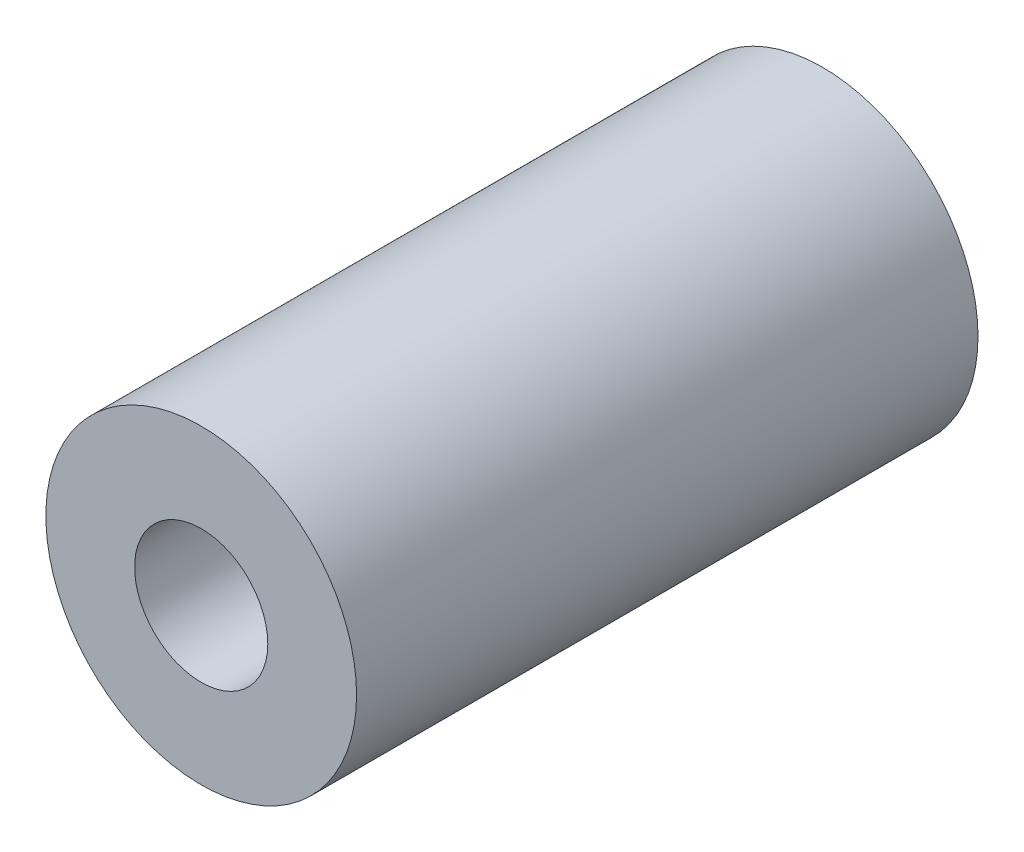
ISO-10303-21;
HEADER;
FILE_DESCRIPTION(('STEP AP214'),'2;1');
FILE_NAME('part.step','',(''),(''),'','','');
FILE_SCHEMA(('AUTOMOTIVE_DESIGN { 1 0 10303 214 1 1 1 1 }'));
ENDSEC;
DATA;
#1=APPLICATION_CONTEXT('core data for automotive mechanical design processes');
#2=APPLICATION_PROTOCOL_DEFINITION('international standard','automotive_design',2000,#1);
#3=PRODUCT_CONTEXT('',#1,'mechanical');
#4=PRODUCT('Part','Part','',(#3));
#5=PRODUCT_RELATED_PRODUCT_CATEGORY('part','',(#4));
#6=PRODUCT_DEFINITION_FORMATION('','',#4);
#7=PRODUCT_DEFINITION_CONTEXT('part definition',#1,'design');
#8=PRODUCT_DEFINITION('design','',#6,#7);
#9=PRODUCT_DEFINITION_SHAPE('','',#8);
#10=(LENGTH_UNIT() NAMED_UNIT(*) SI_UNIT(.MILLI.,.METRE.));
#11=(NAMED_UNIT(*) PLANE_ANGLE_UNIT() SI_UNIT($,.RADIAN.));
#12=(NAMED_UNIT(*) SI_UNIT($,.STERADIAN.) SOLID_ANGLE_UNIT());
#13=UNCERTAINTY_MEASURE_WITH_UNIT(LENGTH_MEASURE(1.E-05),#10,'distance_accuracy_value','');
#14=(GEOMETRIC_REPRESENTATION_CONTEXT(3) GLOBAL_UNCERTAINTY_ASSIGNED_CONTEXT((#13)) GLOBAL_UNIT_ASSIGNED_CONTEXT((#10,
#11,#12)) REPRESENTATION_CONTEXT('',''));
#15=CARTESIAN_POINT('',(0.,0.,0.));
#16=DIRECTION('',(0.,0.,1.));
#17=DIRECTION('',(1.,0.,0.));
#18=AXIS2_PLACEMENT_3D('',#15,#16,#17);
#19=CARTESIAN_POINT('',(0.,0.,44.45));
#20=DIRECTION('',(0.,0.,1.));
#21=DIRECTION('',(1.,0.,0.));
#22=AXIS2_PLACEMENT_3D('',#19,#20,#21);
#23=PLANE('',#22);
#24=CARTESIAN_POINT('',(0.,0.,44.45));
#25=DIRECTION('',(0.,0.,1.));
#26=DIRECTION('',(1.,0.,0.));
#27=AXIS2_PLACEMENT_3D('',#24,#25,#26);
#28=CIRCLE('',#27,11.1125);
#29=CARTESIAN_POINT('',(11.1125,0.,44.45));
#30=VERTEX_POINT('',#29);
#31=EDGE_CURVE('E10',#30,#30,#28,.T.);
#32=ORIENTED_EDGE('',*,*,#31,.T.);
#33=EDGE_LOOP('',(#32));
#34=FACE_BOUND('',#33,.T.);
#35=CARTESIAN_POINT('',(0.,0.,44.45));
#36=DIRECTION('',(0.,0.,1.));
#37=DIRECTION('',(1.,0.,0.));
#38=AXIS2_PLACEMENT_3D('',#35,#36,#37);
#39=CIRCLE('',#38,4.7625);
#40=CARTESIAN_POINT('',(4.7625,0.,44.45));
#41=VERTEX_POINT('',#40);
#42=EDGE_CURVE('E44',#41,#41,#39,.T.);
#43=ORIENTED_EDGE('',*,*,#42,.F.);
#44=EDGE_LOOP('',(#43));
#45=FACE_BOUND('',#44,.T.);
#46=ADVANCED_FACE('F33',(#34,#45),#23,.T.);
#47=CARTESIAN_POINT('',(0.,0.,0.));
#48=DIRECTION('',(0.,0.,1.));
#49=DIRECTION('',(1.,0.,0.));
#50=AXIS2_PLACEMENT_3D('',#47,#48,#49);
#51=PLANE('',#50);
#52=CARTESIAN_POINT('',(0.,0.,0.));
#53=DIRECTION('',(0.,0.,1.));
#54=DIRECTION('',(1.,0.,0.));
#55=AXIS2_PLACEMENT_3D('',#52,#53,#54);
#56=CIRCLE('',#55,11.1125);
#57=CARTESIAN_POINT('',(11.1125,0.,0.));
#58=VERTEX_POINT('',#57);
#59=EDGE_CURVE('E37',#58,#58,#56,.T.);
#60=ORIENTED_EDGE('',*,*,#59,.F.);
#61=EDGE_LOOP('',(#60));
#62=FACE_BOUND('',#61,.T.);
#63=CARTESIAN_POINT('',(0.,0.,0.));
#64=DIRECTION('',(0.,0.,1.));
#65=DIRECTION('',(1.,0.,0.));
#66=AXIS2_PLACEMENT_3D('',#63,#64,#65);
#67=CIRCLE('',#66,4.7625);
#68=CARTESIAN_POINT('',(4.7625,0.,0.));
#69=VERTEX_POINT('',#68);
#70=EDGE_CURVE('E46',#69,#69,#67,.T.);
#71=ORIENTED_EDGE('',*,*,#70,.T.);
#72=EDGE_LOOP('',(#71));
#73=FACE_BOUND('',#72,.T.);
#74=ADVANCED_FACE('F56',(#62,#73),#51,.F.);
#75=CARTESIAN_POINT('',(0.,0.,44.45));
#76=DIRECTION('',(0.,0.,-1.));
#77=DIRECTION('',(-1.,0.,0.));
#78=AXIS2_PLACEMENT_3D('',#75,#76,#77);
#79=CYLINDRICAL_SURFACE('',#78,11.1125);
#80=ORIENTED_EDGE('',*,*,#31,.F.);
#81=EDGE_LOOP('',(#80));
#82=FACE_BOUND('',#81,.T.);
#83=ORIENTED_EDGE('',*,*,#59,.T.);
#84=EDGE_LOOP('',(#83));
#85=FACE_BOUND('',#84,.T.);
#86=ADVANCED_FACE('F35',(#82,#85),#79,.T.);
#87=CARTESIAN_POINT('',(0.,0.,44.45));
#88=DIRECTION('',(0.,0.,-1.));
#89=DIRECTION('',(-1.,0.,0.));
#90=AXIS2_PLACEMENT_3D('',#87,#88,#89);
#91=CYLINDRICAL_SURFACE('',#90,4.7625);
#92=ORIENTED_EDGE('',*,*,#42,.T.);
#93=EDGE_LOOP('',(#92));
#94=FACE_BOUND('',#93,.T.);
#95=ORIENTED_EDGE('',*,*,#70,.F.);
#96=EDGE_LOOP('',(#95));
#97=FACE_BOUND('',#96,.T.);
#98=ADVANCED_FACE('F52',(#94,#97),#91,.F.);
#99=CLOSED_SHELL('',(#46,#74,#86,#98));
#100=MANIFOLD_SOLID_BREP('B2',#99);
#101=ADVANCED_BREP_SHAPE_REPRESENTATION('',(#18,#100),#14);
#102=SHAPE_DEFINITION_REPRESENTATION(#9,#101);
ENDSEC;
END-ISO-10303-21;
